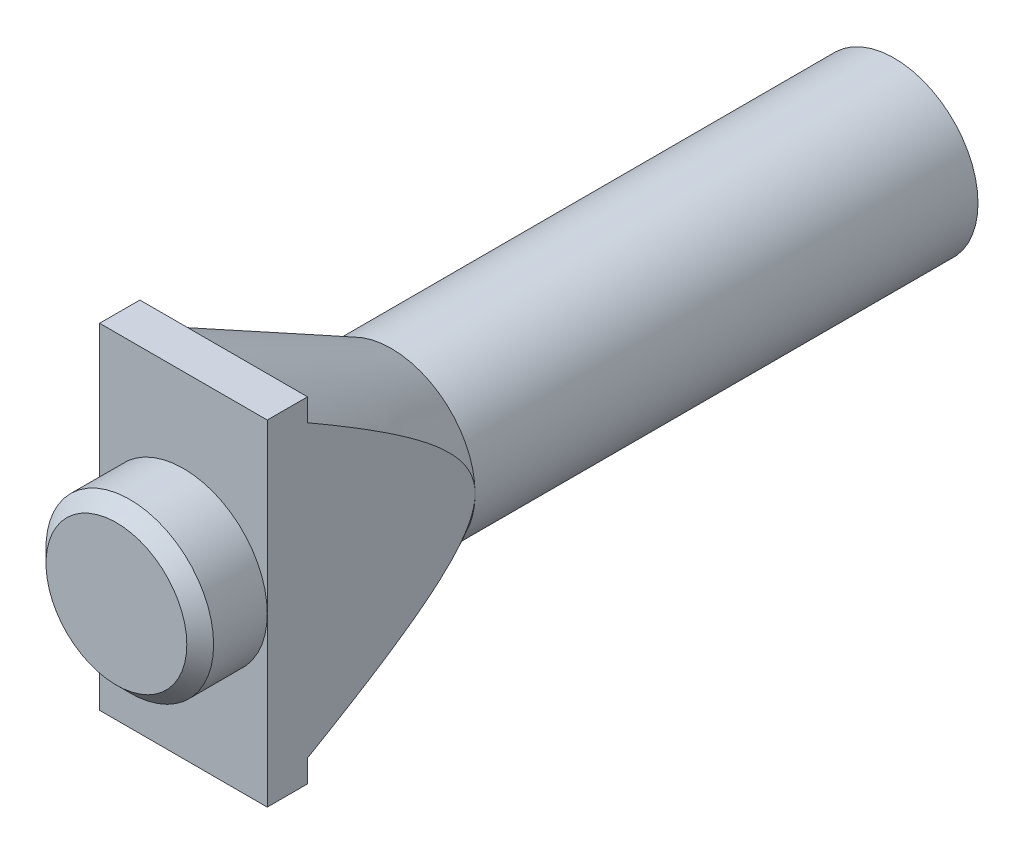
ISO-10303-21;
HEADER;
FILE_DESCRIPTION(('STEP AP214'),'2;1');
FILE_NAME('part.step','',(''),(''),'','','');
FILE_SCHEMA(('AUTOMOTIVE_DESIGN { 1 0 10303 214 1 1 1 1 }'));
ENDSEC;
DATA;
#1=APPLICATION_CONTEXT('core data for automotive mechanical design processes');
#2=APPLICATION_PROTOCOL_DEFINITION('international standard','automotive_design',2000,#1);
#3=PRODUCT_CONTEXT('',#1,'mechanical');
#4=PRODUCT('Part','Part','',(#3));
#5=PRODUCT_RELATED_PRODUCT_CATEGORY('part','',(#4));
#6=PRODUCT_DEFINITION_FORMATION('','',#4);
#7=PRODUCT_DEFINITION_CONTEXT('part definition',#1,'design');
#8=PRODUCT_DEFINITION('design','',#6,#7);
#9=PRODUCT_DEFINITION_SHAPE('','',#8);
#10=(LENGTH_UNIT() NAMED_UNIT(*) SI_UNIT(.MILLI.,.METRE.));
#11=(NAMED_UNIT(*) PLANE_ANGLE_UNIT() SI_UNIT($,.RADIAN.));
#12=(NAMED_UNIT(*) SI_UNIT($,.STERADIAN.) SOLID_ANGLE_UNIT());
#13=UNCERTAINTY_MEASURE_WITH_UNIT(LENGTH_MEASURE(1.E-05),#10,'distance_accuracy_value','');
#14=(GEOMETRIC_REPRESENTATION_CONTEXT(3) GLOBAL_UNCERTAINTY_ASSIGNED_CONTEXT((#13)) GLOBAL_UNIT_ASSIGNED_CONTEXT((#10,
#11,#12)) REPRESENTATION_CONTEXT('',''));
#15=CARTESIAN_POINT('',(0.,0.,0.));
#16=DIRECTION('',(0.,0.,1.));
#17=DIRECTION('',(1.,0.,0.));
#18=AXIS2_PLACEMENT_3D('',#15,#16,#17);
#19=CARTESIAN_POINT('',(0.,0.,53.));
#20=DIRECTION('',(0.,0.,-1.));
#21=DIRECTION('',(-1.,0.,0.));
#22=AXIS2_PLACEMENT_3D('',#19,#20,#21);
#23=PLANE('',#22);
#24=CARTESIAN_POINT('',(0.,0.,53.));
#25=DIRECTION('',(0.,0.,1.));
#26=DIRECTION('',(1.,0.,0.));
#27=AXIS2_PLACEMENT_3D('',#24,#25,#26);
#28=CIRCLE('',#27,6.25);
#29=CARTESIAN_POINT('',(6.25,0.,53.));
#30=VERTEX_POINT('',#29);
#31=CARTESIAN_POINT('',(-6.25,0.,53.));
#32=VERTEX_POINT('',#31);
#33=EDGE_CURVE('E156',#30,#32,#28,.T.);
#34=ORIENTED_EDGE('',*,*,#33,.F.);
#35=DIRECTION('',(0.,1.,0.));
#36=VECTOR('',#35,1.);
#37=CARTESIAN_POINT('',(6.25,12.5,53.));
#38=LINE('',#37,#36);
#39=CARTESIAN_POINT('',(6.25,12.5,53.));
#40=VERTEX_POINT('',#39);
#41=EDGE_CURVE('E145',#30,#40,#38,.T.);
#42=ORIENTED_EDGE('',*,*,#41,.T.);
#43=DIRECTION('',(-1.,0.,0.));
#44=VECTOR('',#43,1.);
#45=CARTESIAN_POINT('',(6.25,12.5,53.));
#46=LINE('',#45,#44);
#47=CARTESIAN_POINT('',(-6.25,12.5,53.));
#48=VERTEX_POINT('',#47);
#49=EDGE_CURVE('E144',#40,#48,#46,.T.);
#50=ORIENTED_EDGE('',*,*,#49,.T.);
#51=DIRECTION('',(0.,-1.,0.));
#52=VECTOR('',#51,1.);
#53=CARTESIAN_POINT('',(-6.25,12.5,53.));
#54=LINE('',#53,#52);
#55=EDGE_CURVE('E158',#48,#32,#54,.T.);
#56=ORIENTED_EDGE('',*,*,#55,.T.);
#57=EDGE_LOOP('',(#34,#42,#50,#56));
#58=FACE_BOUND('',#57,.T.);
#59=ADVANCED_FACE('F32',(#58),#23,.F.);
#60=CARTESIAN_POINT('',(0.,0.,37.5));
#61=DIRECTION('',(0.,0.,1.));
#62=DIRECTION('',(1.,0.,0.));
#63=AXIS2_PLACEMENT_3D('',#60,#61,#62);
#64=CONICAL_SURFACE('',#63,6.25,0.463647609000806);
#65=CARTESIAN_POINT('',(-6.24999999999999,-35.93573144479,97.9503747618082));
#66=CARTESIAN_POINT('',(-6.24999999999999,-34.9702836910054,96.0481305481626));
#67=CARTESIAN_POINT('',(-6.24999999999999,-34.0039993379035,94.146309912995));
#68=CARTESIAN_POINT('',(-6.24999999999999,-32.0690711251266,90.3438479477036));
#69=CARTESIAN_POINT('',(-6.24999999999999,-31.1004272443015,88.4432066283439));
#70=CARTESIAN_POINT('',(-6.24999999999999,-29.1595863728475,84.6424422713417));
#71=CARTESIAN_POINT('',(-6.24999999999999,-28.1873877440386,82.7423200698071));
#72=CARTESIAN_POINT('',(-6.24999999999999,-26.238887791203,78.9441960119309));
#73=CARTESIAN_POINT('',(-6.25,-25.26258649527,77.0461941411822));
#74=CARTESIAN_POINT('',(-6.25,-23.3349071551131,73.3124896487131));
#75=CARTESIAN_POINT('',(-6.24999999999999,-22.3837052780994,71.4766961897524));
#76=CARTESIAN_POINT('',(-6.25,-20.9510516696944,68.7260281776295));
#77=CARTESIAN_POINT('',(-6.25,-20.4725202155631,67.8096328086289));
#78=CARTESIAN_POINT('',(-6.25,-19.5130535891947,65.9781016754991));
#79=CARTESIAN_POINT('',(-6.25,-19.0321184191071,65.0629659102444));
#80=CARTESIAN_POINT('',(-6.25,-18.0674277023791,63.2345774080758));
#81=CARTESIAN_POINT('',(-6.25,-17.5836731658744,62.3213241384819));
#82=CARTESIAN_POINT('',(-6.25,-16.6123906148433,60.4968268430681));
#83=CARTESIAN_POINT('',(-6.25,-16.1248626078094,59.5855828132634));
#84=CARTESIAN_POINT('',(-6.25,-15.1449403322361,57.7657520186573));
#85=CARTESIAN_POINT('',(-6.25,-14.6525462258526,56.8571651666081));
#86=CARTESIAN_POINT('',(-6.25,-13.6612993133427,55.043524626133));
#87=CARTESIAN_POINT('',(-6.25,-13.1624465767017,54.138470899832));
#88=CARTESIAN_POINT('',(-6.25,-12.4188025633043,52.8048875343955));
#89=CARTESIAN_POINT('',(-6.25,-12.1774448436756,52.3744431499155));
#90=CARTESIAN_POINT('',(-6.25,-11.6923190407554,51.5149111936863));
#91=CARTESIAN_POINT('',(-6.25,-11.4485509473752,51.0858236276259));
#92=CARTESIAN_POINT('',(-6.25,-10.9580433812697,50.2291047813945));
#93=CARTESIAN_POINT('',(-6.25,-10.7113026810786,49.8014742033597));
#94=CARTESIAN_POINT('',(-6.25,-10.2143610986928,48.9482295750765));
#95=CARTESIAN_POINT('',(-6.25,-9.96416023949846,48.5226155114492));
#96=CARTESIAN_POINT('',(-6.25,-9.45598172735051,47.6679423940607));
#97=CARTESIAN_POINT('',(-6.25,-9.1979442073017,47.2389188806112));
#98=CARTESIAN_POINT('',(-6.25,-8.6764435646351,46.3841822568384));
#99=CARTESIAN_POINT('',(-6.25,-8.41298052169992,45.9584690980236));
#100=CARTESIAN_POINT('',(-6.25,-7.87941250058685,45.1118155562061));
#101=CARTESIAN_POINT('',(-6.25,-7.60931448559768,44.6908707945666));
#102=CARTESIAN_POINT('',(-6.25,-7.06016319009488,43.8548721723513));
#103=CARTESIAN_POINT('',(-6.25,-6.78111065493566,43.4398178255969));
#104=CARTESIAN_POINT('',(-6.25,-6.34527295984879,42.81169868457));
#105=CARTESIAN_POINT('',(-6.25,-6.19283759765133,42.5956164870185));
#106=CARTESIAN_POINT('',(-6.25,-5.88394271814566,42.1663525478458));
#107=CARTESIAN_POINT('',(-6.25,-5.72748336298804,41.9531706898803));
#108=CARTESIAN_POINT('',(-6.25,-5.40929477194683,41.5298295994951));
#109=CARTESIAN_POINT('',(-6.25,-5.24755199382898,41.3196805144526));
#110=CARTESIAN_POINT('',(-6.25,-4.91818990287503,40.9040565939122));
#111=CARTESIAN_POINT('',(-6.25,-4.75057126429563,40.6985812265365));
#112=CARTESIAN_POINT('',(-6.25,-4.41072215168526,40.2968566977238));
#113=CARTESIAN_POINT('',(-6.25,-4.23860266804845,40.1005141194377));
#114=CARTESIAN_POINT('',(-6.25,-3.88551868858108,39.7156793173894));
#115=CARTESIAN_POINT('',(-6.25,-3.70454949221484,39.5271913662574));
#116=CARTESIAN_POINT('',(-6.25,-3.33249315069517,39.1621773220352));
#117=CARTESIAN_POINT('',(-6.25,-3.14145694768306,38.9855996986065));
#118=CARTESIAN_POINT('',(-6.25,-2.74584936234041,38.6484644768341));
#119=CARTESIAN_POINT('',(-6.25,-2.54129780241234,38.4878842467214));
#120=CARTESIAN_POINT('',(-6.25,-2.2382128704995,38.2762964490722));
#121=CARTESIAN_POINT('',(-6.25,-2.14651659066986,38.2154739634066));
#122=CARTESIAN_POINT('',(-6.25,-1.95986552323845,38.0989611629984));
#123=CARTESIAN_POINT('',(-6.25,-1.86490998334873,38.0432720441981));
#124=CARTESIAN_POINT('',(-6.25,-1.6716234045908,37.9380341896974));
#125=CARTESIAN_POINT('',(-6.25,-1.57329210170714,37.888485935672));
#126=CARTESIAN_POINT('',(-6.25,-1.37325004902009,37.7966934985503));
#127=CARTESIAN_POINT('',(-6.25,-1.27153932185263,37.7544492665423));
#128=CARTESIAN_POINT('',(-6.25,-1.06324975162989,37.6779110254668));
#129=CARTESIAN_POINT('',(-6.25,-0.956618567932666,37.643757912331));
#130=CARTESIAN_POINT('',(-6.25,-0.740594248114185,37.5856321984595));
#131=CARTESIAN_POINT('',(-6.25,-0.631201378287124,37.5616586201095));
#132=CARTESIAN_POINT('',(-6.25,-0.410687118079889,37.5250335961711));
#133=CARTESIAN_POINT('',(-6.25,-0.299568678084801,37.5123646133956));
#134=CARTESIAN_POINT('',(-6.25,-0.0766164083812665,37.4989540416949));
#135=CARTESIAN_POINT('',(-6.25,0.035217304167892,37.4982105470561));
#136=CARTESIAN_POINT('',(-6.25,0.241256944579863,37.5078807980593));
#137=CARTESIAN_POINT('',(-6.25,0.335546095580732,37.51660758727));
#138=CARTESIAN_POINT('',(-6.25,0.523009722045783,37.5422924746225));
#139=CARTESIAN_POINT('',(-6.25,0.616183758321064,37.5592537132436));
#140=CARTESIAN_POINT('',(-6.25,0.893116937011973,37.6216666082942));
#141=CARTESIAN_POINT('',(-6.25,1.07435428792732,37.6786512465365));
#142=CARTESIAN_POINT('',(-6.25,1.38504307355533,37.8005198871093));
#143=CARTESIAN_POINT('',(-6.25,1.51658912716412,37.860332277265));
#144=CARTESIAN_POINT('',(-6.25,1.77394722069846,37.991370141334));
#145=CARTESIAN_POINT('',(-6.25,1.89975563363955,38.0626027093757));
#146=CARTESIAN_POINT('',(-6.25,2.14619737886394,38.2143632838385));
#147=CARTESIAN_POINT('',(-6.25,2.26681012481254,38.2949243001529));
#148=CARTESIAN_POINT('',(-6.25,2.50283514203065,38.463215839296));
#149=CARTESIAN_POINT('',(-6.25,2.61824874618293,38.5509445081682));
#150=CARTESIAN_POINT('',(-6.25,2.90554890951498,38.7810268383601));
#151=CARTESIAN_POINT('',(-6.25,3.07428629320175,38.9273022216295));
#152=CARTESIAN_POINT('',(-6.25,3.40283270986241,39.2296202395062));
#153=CARTESIAN_POINT('',(-6.25,3.56263610284726,39.3856689150643));
#154=CARTESIAN_POINT('',(-6.25,3.8751844495833,39.7053038795755));
#155=CARTESIAN_POINT('',(-6.25,4.02791332576028,39.8689057976443));
#156=CARTESIAN_POINT('',(-6.25,4.32721109581432,40.2015517373946));
#157=CARTESIAN_POINT('',(-6.25,4.47378136388244,40.3705945300085));
#158=CARTESIAN_POINT('',(-6.25,4.76356581930954,40.71500221121));
#159=CARTESIAN_POINT('',(-6.25,4.90671847621852,40.8904186725595));
#160=CARTESIAN_POINT('',(-6.25,5.18866683116403,41.244721252119));
#161=CARTESIAN_POINT('',(-6.25,5.32746231773531,41.4236075380495));
#162=CARTESIAN_POINT('',(-6.25,5.60117084651323,41.783923102278));
#163=CARTESIAN_POINT('',(-6.25,5.7360890689887,41.9653484550513));
#164=CARTESIAN_POINT('',(-6.25,6.00277770464985,42.3304817923942));
#165=CARTESIAN_POINT('',(-6.25,6.13454824673268,42.5141896830242));
#166=CARTESIAN_POINT('',(-6.25,6.4266860458332,42.9278256330222));
#167=CARTESIAN_POINT('',(-6.25,6.5863273646619,43.1582659675533));
#168=CARTESIAN_POINT('',(-6.25,6.90212275957881,43.6215266775284));
#169=CARTESIAN_POINT('',(-6.25,7.05827673792319,43.8543471194165));
#170=CARTESIAN_POINT('',(-6.25,7.52235749009792,44.5557787870353));
#171=CARTESIAN_POINT('',(-6.25,7.82586898694649,45.0273115392177));
#172=CARTESIAN_POINT('',(-6.25,8.42431909454614,45.976035290654));
#173=CARTESIAN_POINT('',(-6.25,8.71925396466096,46.453228634683));
#174=CARTESIAN_POINT('',(-6.25,9.30246709721191,47.4116744203898));
#175=CARTESIAN_POINT('',(-6.25,9.59074519600697,47.8929269614572));
#176=CARTESIAN_POINT('',(-6.25,10.1627483656763,48.859634804301));
#177=CARTESIAN_POINT('',(-6.25,10.4464612906979,49.3450972766051));
#178=CARTESIAN_POINT('',(-6.25,11.0097023581235,50.3184490536114));
#179=CARTESIAN_POINT('',(-6.25,11.2892304454553,50.8063383901386));
#180=CARTESIAN_POINT('',(-6.25,11.8448079120218,51.7839166280907));
#181=CARTESIAN_POINT('',(-6.25,12.1208582137854,52.2736050057992));
#182=CARTESIAN_POINT('',(-6.25,12.6701505469045,53.2545541703248));
#183=CARTESIAN_POINT('',(-6.25,12.9433925721689,53.7458149605494));
#184=CARTESIAN_POINT('',(-6.25,13.6991150202847,55.1121458598155));
#185=CARTESIAN_POINT('',(-6.25,14.179074811521,55.9886099532503));
#186=CARTESIAN_POINT('',(-6.25,15.1335494815208,57.7445821169434));
#187=CARTESIAN_POINT('',(-6.25,15.6080639231843,58.6240904242877));
#188=CARTESIAN_POINT('',(-6.25,16.5509523000127,60.3817737873868));
#189=CARTESIAN_POINT('',(-6.25,17.0193433873885,61.2599396475644));
#190=CARTESIAN_POINT('',(-6.25,17.7194433712972,62.5784533126796));
#191=CARTESIAN_POINT('',(-6.25,17.9523845365945,63.0181476712611));
#192=CARTESIAN_POINT('',(-6.25,18.4175287913747,63.8979259540562));
#193=CARTESIAN_POINT('',(-6.25,18.6497318817617,64.3380098777916));
#194=CARTESIAN_POINT('',(-6.25,18.8816078338311,64.778266145753));
#195=B_SPLINE_CURVE_WITH_KNOTS('',3,(#65,#66,#67,#68,#69,#70,#71,#72,#73,#74,#75,#76,#77,#78,
#79,#80,#81,#82,#83,#84,#85,#86,#87,#88,#89,#90,#91,#92,#93,#94,#95,#96,#97,#98,#99,#100,#101,
#102,#103,#104,#105,#106,#107,#108,#109,#110,#111,#112,#113,#114,#115,#116,#117,#118,#119,#120,
#121,#122,#123,#124,#125,#126,#127,#128,#129,#130,#131,#132,#133,#134,#135,#136,#137,#138,#139,
#140,#141,#142,#143,#144,#145,#146,#147,#148,#149,#150,#151,#152,#153,#154,#155,#156,#157,#158,
#159,#160,#161,#162,#163,#164,#165,#166,#167,#168,#169,#170,#171,#172,#173,#174,#175,#176,#177,
#178,#179,#180,#181,#182,#183,#184,#185,#186,#187,#188,#189,#190,#191,#192,#193,#194),
.UNSPECIFIED.,.F.,.F.,(4,2,2,2,2,2,2,2,2,2,2,2,2,2,2,2,2,2,2,2,2,2,2,2,2,2,2,2,2,2,2,2,2,2,2,2,
2,2,2,2,2,2,2,2,2,2,2,2,2,2,2,2,2,2,2,2,2,2,2,2,2,2,2,2,4),(0.,6.39965752074005,
12.7993726186289,19.202548560361,25.6056807264662,31.8084315940121,34.9098729818095,
38.0113115965983,41.1117000475619,44.2120823441206,47.3123616708882,50.4126076708107,
51.8930823940815,53.3735633165103,54.8546780829145,56.3357830088131,57.8376844321262,
59.3395638132854,60.8399292115256,62.3401700449834,63.1334514819569,63.9267010028383,
64.7221740075189,65.5175560283361,66.3006716211194,67.0842077829721,67.8641017849388,
68.6428763048937,68.9728468858856,69.3028941482673,69.6329672824244,69.9630382061441,
70.2984922380803,70.6339140466511,70.9688145952096,71.3036616255513,71.5873596809747,
71.8711660191168,72.4385795851788,72.8715373850204,73.3047651845618,73.7395757732675,
74.1742742494886,74.8436458955432,75.5134354489368,76.1846791595783,76.85577228922,
77.5349333072021,78.2141272359047,78.8923670098825,79.5705789622418,80.4115454698463,
81.2525355187096,82.9346941872702,84.61757583672,86.3004988119105,87.9873350797189,
89.6741935266861,91.3605946688404,93.0469994680155,96.0447948993375,99.0428293047575,
102.028634502359,103.521394662366,105.014152993186),.UNSPECIFIED.);
#196=CARTESIAN_POINT('',(-6.25,10.8253175473055,50.));
#197=VERTEX_POINT('',#196);
#198=CARTESIAN_POINT('',(-6.25,0.,37.5));
#199=VERTEX_POINT('',#198);
#200=EDGE_CURVE('E172',#197,#199,#195,.F.);
#201=ORIENTED_EDGE('',*,*,#200,.F.);
#202=CARTESIAN_POINT('',(0.,0.,50.));
#203=DIRECTION('',(0.,0.,-1.));
#204=DIRECTION('',(-1.,0.,0.));
#205=AXIS2_PLACEMENT_3D('',#202,#203,#204);
#206=CIRCLE('',#205,12.5);
#207=CARTESIAN_POINT('',(0.,12.5,50.));
#208=VERTEX_POINT('',#207);
#209=EDGE_CURVE('E571',#197,#208,#206,.T.);
#210=ORIENTED_EDGE('',*,*,#209,.T.);
#211=CARTESIAN_POINT('',(6.25,10.8253175473055,50.));
#212=VERTEX_POINT('',#211);
#213=EDGE_CURVE('E579',#208,#212,#206,.T.);
#214=ORIENTED_EDGE('',*,*,#213,.T.);
#215=CARTESIAN_POINT('',(6.25000000000001,-35.9357314447899,97.9503747618082));
#216=CARTESIAN_POINT('',(6.25000000000001,-34.9702836910053,96.0481305481626));
#217=CARTESIAN_POINT('',(6.25000000000001,-34.0039993379035,94.146309912995));
#218=CARTESIAN_POINT('',(6.25000000000001,-32.0690711251266,90.3438479477036));
#219=CARTESIAN_POINT('',(6.25000000000001,-31.1004272443015,88.4432066283439));
#220=CARTESIAN_POINT('',(6.25000000000001,-29.1595863728474,84.6424422713416));
#221=CARTESIAN_POINT('',(6.25,-28.1873877440385,82.7423200698071));
#222=CARTESIAN_POINT('',(6.25,-26.238887791203,78.9441960119309));
#223=CARTESIAN_POINT('',(6.25,-25.26258649527,77.0461941411822));
#224=CARTESIAN_POINT('',(6.25,-23.3349071551131,73.3124896487131));
#225=CARTESIAN_POINT('',(6.25,-22.3837052780994,71.4766961897524));
#226=CARTESIAN_POINT('',(6.25,-20.9510516696944,68.7260281776294));
#227=CARTESIAN_POINT('',(6.25,-20.4725202155631,67.8096328086288));
#228=CARTESIAN_POINT('',(6.25,-19.5130535891947,65.9781016754991));
#229=CARTESIAN_POINT('',(6.25,-19.0321184191071,65.0629659102444));
#230=CARTESIAN_POINT('',(6.25,-18.0674277023791,63.2345774080758));
#231=CARTESIAN_POINT('',(6.25,-17.5836731658744,62.3213241384818));
#232=CARTESIAN_POINT('',(6.25,-16.6123906148433,60.4968268430681));
#233=CARTESIAN_POINT('',(6.25,-16.1248626078094,59.5855828132634));
#234=CARTESIAN_POINT('',(6.25,-15.1449403322361,57.7657520186573));
#235=CARTESIAN_POINT('',(6.25,-14.6525462258526,56.857165166608));
#236=CARTESIAN_POINT('',(6.25,-13.6612993133427,55.043524626133));
#237=CARTESIAN_POINT('',(6.25,-13.1624465767017,54.138470899832));
#238=CARTESIAN_POINT('',(6.25,-12.4188025633043,52.8048875343955));
#239=CARTESIAN_POINT('',(6.25,-12.1774448436756,52.3744431499155));
#240=CARTESIAN_POINT('',(6.25,-11.6923190407554,51.5149111936863));
#241=CARTESIAN_POINT('',(6.25,-11.4485509473752,51.0858236276259));
#242=CARTESIAN_POINT('',(6.25,-10.9580433812697,50.2291047813945));
#243=CARTESIAN_POINT('',(6.25,-10.7113026810786,49.8014742033597));
#244=CARTESIAN_POINT('',(6.25,-10.2143610986928,48.9482295750766));
#245=CARTESIAN_POINT('',(6.25,-9.96416023949846,48.5226155114492));
#246=CARTESIAN_POINT('',(6.25,-9.45598172735052,47.6679423940607));
#247=CARTESIAN_POINT('',(6.25,-9.1979442073017,47.2389188806112));
#248=CARTESIAN_POINT('',(6.25,-8.6764435646351,46.3841822568384));
#249=CARTESIAN_POINT('',(6.25,-8.41298052169992,45.9584690980236));
#250=CARTESIAN_POINT('',(6.25,-7.87941250058685,45.1118155562061));
#251=CARTESIAN_POINT('',(6.25,-7.60931448559768,44.6908707945666));
#252=CARTESIAN_POINT('',(6.25,-7.06016319009488,43.8548721723513));
#253=CARTESIAN_POINT('',(6.25,-6.78111065493566,43.4398178255969));
#254=CARTESIAN_POINT('',(6.25,-6.34527295984879,42.81169868457));
#255=CARTESIAN_POINT('',(6.25,-6.19283759765133,42.5956164870185));
#256=CARTESIAN_POINT('',(6.25,-5.88394271814566,42.1663525478458));
#257=CARTESIAN_POINT('',(6.25,-5.72748336298804,41.9531706898803));
#258=CARTESIAN_POINT('',(6.25,-5.40929477194683,41.5298295994951));
#259=CARTESIAN_POINT('',(6.25,-5.24755199382898,41.3196805144526));
#260=CARTESIAN_POINT('',(6.25,-4.91818990287502,40.9040565939122));
#261=CARTESIAN_POINT('',(6.25,-4.75057126429562,40.6985812265365));
#262=CARTESIAN_POINT('',(6.25,-4.41072215168525,40.2968566977238));
#263=CARTESIAN_POINT('',(6.25,-4.23860266804843,40.1005141194376));
#264=CARTESIAN_POINT('',(6.25,-3.88551868858107,39.7156793173894));
#265=CARTESIAN_POINT('',(6.25,-3.70454949221482,39.5271913662574));
#266=CARTESIAN_POINT('',(6.25,-3.33249315069516,39.1621773220352));
#267=CARTESIAN_POINT('',(6.25,-3.14145694768304,38.9855996986065));
#268=CARTESIAN_POINT('',(6.25,-2.7458493623404,38.6484644768341));
#269=CARTESIAN_POINT('',(6.25,-2.54129780241234,38.4878842467214));
#270=CARTESIAN_POINT('',(6.25,-2.23821287049949,38.2762964490722));
#271=CARTESIAN_POINT('',(6.25,-2.14651659066986,38.2154739634066));
#272=CARTESIAN_POINT('',(6.25,-1.95986552323844,38.0989611629984));
#273=CARTESIAN_POINT('',(6.25,-1.86490998334872,38.0432720441981));
#274=CARTESIAN_POINT('',(6.25,-1.6716234045908,37.9380341896974));
#275=CARTESIAN_POINT('',(6.25,-1.57329210170714,37.888485935672));
#276=CARTESIAN_POINT('',(6.25,-1.37325004902009,37.7966934985503));
#277=CARTESIAN_POINT('',(6.25,-1.27153932185263,37.7544492665423));
#278=CARTESIAN_POINT('',(6.25,-1.06324975162989,37.6779110254668));
#279=CARTESIAN_POINT('',(6.25,-0.956618567932661,37.643757912331));
#280=CARTESIAN_POINT('',(6.25,-0.740594248114179,37.5856321984595));
#281=CARTESIAN_POINT('',(6.25,-0.631201378287119,37.5616586201095));
#282=CARTESIAN_POINT('',(6.25,-0.410687118079889,37.5250335961711));
#283=CARTESIAN_POINT('',(6.25,-0.299568678084807,37.5123646133956));
#284=CARTESIAN_POINT('',(6.25,-0.0766164083812734,37.4989540416949));
#285=CARTESIAN_POINT('',(6.25,0.0352173041678898,37.4982105470561));
#286=CARTESIAN_POINT('',(6.25,0.241256944579866,37.5078807980593));
#287=CARTESIAN_POINT('',(6.25,0.335546095580736,37.51660758727));
#288=CARTESIAN_POINT('',(6.25,0.523009722045787,37.5422924746225));
#289=CARTESIAN_POINT('',(6.25,0.616183758321068,37.5592537132436));
#290=CARTESIAN_POINT('',(6.25,0.893116937011978,37.6216666082942));
#291=CARTESIAN_POINT('',(6.25,1.07435428792732,37.6786512465365));
#292=CARTESIAN_POINT('',(6.25,1.38504307355533,37.8005198871093));
#293=CARTESIAN_POINT('',(6.25,1.51658912716412,37.860332277265));
#294=CARTESIAN_POINT('',(6.25,1.77394722069846,37.991370141334));
#295=CARTESIAN_POINT('',(6.25,1.89975563363955,38.0626027093757));
#296=CARTESIAN_POINT('',(6.25,2.14619737886395,38.2143632838385));
#297=CARTESIAN_POINT('',(6.25,2.26681012481255,38.2949243001529));
#298=CARTESIAN_POINT('',(6.25,2.50283514203065,38.463215839296));
#299=CARTESIAN_POINT('',(6.25,2.61824874618294,38.5509445081682));
#300=CARTESIAN_POINT('',(6.25,2.90554890951498,38.7810268383601));
#301=CARTESIAN_POINT('',(6.25,3.07428629320175,38.9273022216295));
#302=CARTESIAN_POINT('',(6.25,3.40283270986242,39.2296202395062));
#303=CARTESIAN_POINT('',(6.25,3.56263610284726,39.3856689150643));
#304=CARTESIAN_POINT('',(6.25,3.8751844495833,39.7053038795755));
#305=CARTESIAN_POINT('',(6.25,4.02791332576028,39.8689057976443));
#306=CARTESIAN_POINT('',(6.25,4.32721109581433,40.2015517373946));
#307=CARTESIAN_POINT('',(6.25,4.47378136388245,40.3705945300085));
#308=CARTESIAN_POINT('',(6.25,4.76356581930954,40.71500221121));
#309=CARTESIAN_POINT('',(6.25,4.90671847621853,40.8904186725595));
#310=CARTESIAN_POINT('',(6.25,5.18866683116404,41.244721252119));
#311=CARTESIAN_POINT('',(6.25,5.32746231773532,41.4236075380495));
#312=CARTESIAN_POINT('',(6.25,5.60117084651324,41.783923102278));
#313=CARTESIAN_POINT('',(6.25,5.73608906898871,41.9653484550513));
#314=CARTESIAN_POINT('',(6.25,6.00277770464986,42.3304817923942));
#315=CARTESIAN_POINT('',(6.25,6.13454824673269,42.5141896830242));
#316=CARTESIAN_POINT('',(6.25,6.42668604583321,42.9278256330222));
#317=CARTESIAN_POINT('',(6.25,6.58632736466191,43.1582659675533));
#318=CARTESIAN_POINT('',(6.25,6.90212275957883,43.6215266775284));
#319=CARTESIAN_POINT('',(6.25,7.05827673792321,43.8543471194166));
#320=CARTESIAN_POINT('',(6.25,7.52235749009793,44.5557787870353));
#321=CARTESIAN_POINT('',(6.25,7.82586898694649,45.0273115392178));
#322=CARTESIAN_POINT('',(6.25,8.42431909454614,45.976035290654));
#323=CARTESIAN_POINT('',(6.25,8.71925396466097,46.453228634683));
#324=CARTESIAN_POINT('',(6.25,9.30246709721192,47.4116744203898));
#325=CARTESIAN_POINT('',(6.25,9.59074519600698,47.8929269614572));
#326=CARTESIAN_POINT('',(6.25,10.1627483656763,48.859634804301));
#327=CARTESIAN_POINT('',(6.25,10.4464612906979,49.3450972766051));
#328=CARTESIAN_POINT('',(6.25,11.0097023581235,50.3184490536115));
#329=CARTESIAN_POINT('',(6.25,11.2892304454553,50.8063383901386));
#330=CARTESIAN_POINT('',(6.25,11.8448079120219,51.7839166280907));
#331=CARTESIAN_POINT('',(6.25,12.1208582137854,52.2736050057992));
#332=CARTESIAN_POINT('',(6.25,12.6701505469045,53.2545541703248));
#333=CARTESIAN_POINT('',(6.25,12.9433925721689,53.7458149605494));
#334=CARTESIAN_POINT('',(6.25,13.6991150202848,55.1121458598155));
#335=CARTESIAN_POINT('',(6.25,14.179074811521,55.9886099532503));
#336=CARTESIAN_POINT('',(6.25,15.1335494815208,57.7445821169435));
#337=CARTESIAN_POINT('',(6.25,15.6080639231843,58.6240904242877));
#338=CARTESIAN_POINT('',(6.25,16.5509523000127,60.3817737873868));
#339=CARTESIAN_POINT('',(6.25,17.0193433873886,61.2599396475645));
#340=CARTESIAN_POINT('',(6.25,17.7194433712972,62.5784533126796));
#341=CARTESIAN_POINT('',(6.25,17.9523845365945,63.0181476712612));
#342=CARTESIAN_POINT('',(6.25,18.4175287913747,63.8979259540563));
#343=CARTESIAN_POINT('',(6.25,18.6497318817617,64.3380098777917));
#344=CARTESIAN_POINT('',(6.25,18.8816078338311,64.7782661457531));
#345=B_SPLINE_CURVE_WITH_KNOTS('',3,(#215,#216,#217,#218,#219,#220,#221,#222,#223,#224,#225,
#226,#227,#228,#229,#230,#231,#232,#233,#234,#235,#236,#237,#238,#239,#240,#241,#242,#243,#244,
#245,#246,#247,#248,#249,#250,#251,#252,#253,#254,#255,#256,#257,#258,#259,#260,#261,#262,#263,
#264,#265,#266,#267,#268,#269,#270,#271,#272,#273,#274,#275,#276,#277,#278,#279,#280,#281,#282,
#283,#284,#285,#286,#287,#288,#289,#290,#291,#292,#293,#294,#295,#296,#297,#298,#299,#300,#301,
#302,#303,#304,#305,#306,#307,#308,#309,#310,#311,#312,#313,#314,#315,#316,#317,#318,#319,#320,
#321,#322,#323,#324,#325,#326,#327,#328,#329,#330,#331,#332,#333,#334,#335,#336,#337,#338,#339,
#340,#341,#342,#343,#344),.UNSPECIFIED.,.F.,.F.,(4,2,2,2,2,2,2,2,2,2,2,2,2,2,2,2,2,2,2,2,2,2,2,
2,2,2,2,2,2,2,2,2,2,2,2,2,2,2,2,2,2,2,2,2,2,2,2,2,2,2,2,2,2,2,2,2,2,2,2,2,2,2,2,2,4),(0.,
6.39965752074007,12.799372618629,19.2025485603611,25.6056807264663,31.8084315940122,
34.9098729818096,38.0113115965984,41.1117000475619,44.2120823441207,47.3123616708882,
50.4126076708107,51.8930823940815,53.3735633165103,54.8546780829145,56.3357830088131,
57.8376844321262,59.3395638132854,60.8399292115256,62.3401700449834,63.1334514819569,
63.9267010028383,64.7221740075189,65.5175560283361,66.3006716211194,67.0842077829721,
67.8641017849389,68.6428763048937,68.9728468858856,69.3028941482673,69.6329672824244,
69.9630382061441,70.2984922380803,70.6339140466511,70.9688145952095,71.3036616255513,
71.5873596809747,71.8711660191168,72.4385795851788,72.8715373850204,73.3047651845618,
73.7395757732675,74.1742742494886,74.8436458955432,75.5134354489368,76.1846791595783,
76.85577228922,77.5349333072021,78.2141272359047,78.8923670098825,79.5705789622418,
80.4115454698463,81.2525355187096,82.9346941872702,84.61757583672,86.3004988119105,
87.9873350797189,89.6741935266862,91.3605946688404,93.0469994680156,96.0447948993375,
99.0428293047575,102.028634502359,103.521394662366,105.014152993186),.UNSPECIFIED.);
#346=CARTESIAN_POINT('',(6.25,0.,37.5));
#347=VERTEX_POINT('',#346);
#348=EDGE_CURVE('E182',#347,#212,#345,.T.);
#349=ORIENTED_EDGE('',*,*,#348,.F.);
#350=CARTESIAN_POINT('',(0.,0.,37.5));
#351=DIRECTION('',(0.,0.,-1.));
#352=DIRECTION('',(-1.,0.,0.));
#353=AXIS2_PLACEMENT_3D('',#350,#351,#352);
#354=CIRCLE('',#353,6.25);
#355=EDGE_CURVE('E566',#199,#347,#354,.T.);
#356=ORIENTED_EDGE('',*,*,#355,.F.);
#357=EDGE_LOOP('',(#201,#210,#214,#349,#356));
#358=FACE_BOUND('',#357,.T.);
#359=ADVANCED_FACE('F196',(#358),#64,.T.);
#360=CARTESIAN_POINT('',(0.,0.,50.));
#361=DIRECTION('',(0.,0.,-1.));
#362=DIRECTION('',(-1.,0.,0.));
#363=AXIS2_PLACEMENT_3D('',#360,#361,#362);
#364=CYLINDRICAL_SURFACE('',#363,6.25);
#365=CARTESIAN_POINT('',(0.,0.,0.));
#366=DIRECTION('',(0.,0.,1.));
#367=DIRECTION('',(1.,0.,0.));
#368=AXIS2_PLACEMENT_3D('',#365,#366,#367);
#369=CIRCLE('',#368,6.25);
#370=CARTESIAN_POINT('',(6.25,0.,0.));
#371=VERTEX_POINT('',#370);
#372=EDGE_CURVE('E531',#371,#371,#369,.T.);
#373=ORIENTED_EDGE('',*,*,#372,.T.);
#374=EDGE_LOOP('',(#373));
#375=FACE_BOUND('',#374,.T.);
#376=EDGE_CURVE('E568',#347,#199,#354,.T.);
#377=ORIENTED_EDGE('',*,*,#376,.T.);
#378=ORIENTED_EDGE('',*,*,#355,.T.);
#379=EDGE_LOOP('',(#377,#378));
#380=FACE_BOUND('',#379,.T.);
#381=ADVANCED_FACE('F259',(#375,#380),#364,.T.);
#382=CARTESIAN_POINT('',(0.,0.,0.));
#383=DIRECTION('',(0.,0.,1.));
#384=DIRECTION('',(1.,0.,0.));
#385=AXIS2_PLACEMENT_3D('',#382,#383,#384);
#386=PLANE('',#385);
#387=CARTESIAN_POINT('',(0.,0.,0.));
#388=DIRECTION('',(0.,0.,-1.));
#389=DIRECTION('',(-1.,0.,0.));
#390=AXIS2_PLACEMENT_3D('',#387,#388,#389);
#391=CIRCLE('',#390,2.15);
#392=CARTESIAN_POINT('',(-2.15,0.,0.));
#393=VERTEX_POINT('',#392);
#394=EDGE_CURVE('E528',#393,#393,#391,.T.);
#395=ORIENTED_EDGE('',*,*,#394,.F.);
#396=EDGE_LOOP('',(#395));
#397=FACE_BOUND('',#396,.T.);
#398=ORIENTED_EDGE('',*,*,#372,.F.);
#399=EDGE_LOOP('',(#398));
#400=FACE_BOUND('',#399,.T.);
#401=ADVANCED_FACE('F256',(#397,#400),#386,.F.);
#402=CARTESIAN_POINT('',(0.,0.,25.));
#403=DIRECTION('',(0.,0.,-1.));
#404=DIRECTION('',(-1.,0.,0.));
#405=AXIS2_PLACEMENT_3D('',#402,#403,#404);
#406=CYLINDRICAL_SURFACE('',#405,2.15);
#407=CARTESIAN_POINT('',(0.,0.,25.));
#408=DIRECTION('',(0.,0.,-1.));
#409=DIRECTION('',(-1.,0.,0.));
#410=AXIS2_PLACEMENT_3D('',#407,#408,#409);
#411=CIRCLE('',#410,2.15);
#412=CARTESIAN_POINT('',(-2.15,0.,25.));
#413=VERTEX_POINT('',#412);
#414=EDGE_CURVE('E516',#413,#413,#411,.T.);
#415=ORIENTED_EDGE('',*,*,#414,.F.);
#416=EDGE_LOOP('',(#415));
#417=FACE_BOUND('',#416,.T.);
#418=ORIENTED_EDGE('',*,*,#394,.T.);
#419=EDGE_LOOP('',(#418));
#420=FACE_BOUND('',#419,.T.);
#421=ADVANCED_FACE('F252',(#417,#420),#406,.F.);
#422=CARTESIAN_POINT('',(-2.07846096908265,-3.6,28.5));
#423=DIRECTION('',(-0.866025403784439,-0.5,0.));
#424=DIRECTION('',(0.5,-0.866025403784439,0.));
#425=AXIS2_PLACEMENT_3D('',#422,#423,#424);
#426=PLANE('',#425);
#427=DIRECTION('',(-0.5,0.866025403784439,0.));
#428=VECTOR('',#427,1.);
#429=CARTESIAN_POINT('',(-2.07846096908265,-3.6,25.));
#430=LINE('',#429,#428);
#431=CARTESIAN_POINT('',(-2.07846096908265,-3.6,25.));
#432=VERTEX_POINT('',#431);
#433=CARTESIAN_POINT('',(-4.15692193816531,0.,25.));
#434=VERTEX_POINT('',#433);
#435=EDGE_CURVE('E500',#432,#434,#430,.T.);
#436=ORIENTED_EDGE('',*,*,#435,.T.);
#437=DIRECTION('',(0.,0.,-1.));
#438=VECTOR('',#437,1.);
#439=CARTESIAN_POINT('',(-4.15692193816531,0.,28.5));
#440=LINE('',#439,#438);
#441=CARTESIAN_POINT('',(-4.15692193816531,0.,28.5));
#442=VERTEX_POINT('',#441);
#443=EDGE_CURVE('E499',#442,#434,#440,.T.);
#444=ORIENTED_EDGE('',*,*,#443,.F.);
#445=DIRECTION('',(-0.5,0.866025403784439,0.));
#446=VECTOR('',#445,1.);
#447=CARTESIAN_POINT('',(-2.07846096908265,-3.6,28.5));
#448=LINE('',#447,#446);
#449=CARTESIAN_POINT('',(-2.07846096908265,-3.6,28.5));
#450=VERTEX_POINT('',#449);
#451=EDGE_CURVE('E474',#450,#442,#448,.T.);
#452=ORIENTED_EDGE('',*,*,#451,.F.);
#453=DIRECTION('',(0.,0.,-1.));
#454=VECTOR('',#453,1.);
#455=CARTESIAN_POINT('',(-2.07846096908265,-3.6,28.5));
#456=LINE('',#455,#454);
#457=EDGE_CURVE('E514',#450,#432,#456,.T.);
#458=ORIENTED_EDGE('',*,*,#457,.T.);
#459=EDGE_LOOP('',(#436,#444,#452,#458));
#460=FACE_BOUND('',#459,.T.);
#461=ADVANCED_FACE('F234',(#460),#426,.F.);
#462=CARTESIAN_POINT('',(2.07846096908265,-3.6,28.5));
#463=DIRECTION('',(0.,-1.,0.));
#464=DIRECTION('',(1.,0.,0.));
#465=AXIS2_PLACEMENT_3D('',#462,#463,#464);
#466=PLANE('',#465);
#467=DIRECTION('',(-1.,0.,0.));
#468=VECTOR('',#467,1.);
#469=CARTESIAN_POINT('',(2.07846096908265,-3.6,25.));
#470=LINE('',#469,#468);
#471=CARTESIAN_POINT('',(2.07846096908265,-3.6,25.));
#472=VERTEX_POINT('',#471);
#473=EDGE_CURVE('E481',#472,#432,#470,.T.);
#474=ORIENTED_EDGE('',*,*,#473,.T.);
#475=ORIENTED_EDGE('',*,*,#457,.F.);
#476=DIRECTION('',(-1.,0.,0.));
#477=VECTOR('',#476,1.);
#478=CARTESIAN_POINT('',(2.07846096908265,-3.6,28.5));
#479=LINE('',#478,#477);
#480=CARTESIAN_POINT('',(2.07846096908265,-3.6,28.5));
#481=VERTEX_POINT('',#480);
#482=EDGE_CURVE('E480',#481,#450,#479,.T.);
#483=ORIENTED_EDGE('',*,*,#482,.F.);
#484=DIRECTION('',(0.,0.,-1.));
#485=VECTOR('',#484,1.);
#486=CARTESIAN_POINT('',(2.07846096908265,-3.6,28.5));
#487=LINE('',#486,#485);
#488=EDGE_CURVE('E517',#481,#472,#487,.T.);
#489=ORIENTED_EDGE('',*,*,#488,.T.);
#490=EDGE_LOOP('',(#474,#475,#483,#489));
#491=FACE_BOUND('',#490,.T.);
#492=ADVANCED_FACE('F230',(#491),#466,.F.);
#493=CARTESIAN_POINT('',(4.15692193816531,0.,28.5));
#494=DIRECTION('',(0.866025403784439,-0.5,0.));
#495=DIRECTION('',(0.5,0.866025403784439,0.));
#496=AXIS2_PLACEMENT_3D('',#493,#494,#495);
#497=PLANE('',#496);
#498=DIRECTION('',(-0.5,-0.866025403784439,0.));
#499=VECTOR('',#498,1.);
#500=CARTESIAN_POINT('',(4.15692193816531,0.,25.));
#501=LINE('',#500,#499);
#502=CARTESIAN_POINT('',(4.15692193816531,0.,25.));
#503=VERTEX_POINT('',#502);
#504=EDGE_CURVE('E486',#503,#472,#501,.T.);
#505=ORIENTED_EDGE('',*,*,#504,.T.);
#506=ORIENTED_EDGE('',*,*,#488,.F.);
#507=DIRECTION('',(-0.5,-0.866025403784439,0.));
#508=VECTOR('',#507,1.);
#509=CARTESIAN_POINT('',(4.15692193816531,0.,28.5));
#510=LINE('',#509,#508);
#511=CARTESIAN_POINT('',(4.15692193816531,0.,28.5));
#512=VERTEX_POINT('',#511);
#513=EDGE_CURVE('E496',#512,#481,#510,.T.);
#514=ORIENTED_EDGE('',*,*,#513,.F.);
#515=DIRECTION('',(0.,0.,-1.));
#516=VECTOR('',#515,1.);
#517=CARTESIAN_POINT('',(4.15692193816531,0.,28.5));
#518=LINE('',#517,#516);
#519=EDGE_CURVE('E519',#512,#503,#518,.T.);
#520=ORIENTED_EDGE('',*,*,#519,.T.);
#521=EDGE_LOOP('',(#505,#506,#514,#520));
#522=FACE_BOUND('',#521,.T.);
#523=ADVANCED_FACE('F233',(#522),#497,.F.);
#524=CARTESIAN_POINT('',(2.07846096908265,3.6,28.5));
#525=DIRECTION('',(0.866025403784439,0.5,0.));
#526=DIRECTION('',(-0.5,0.866025403784439,0.));
#527=AXIS2_PLACEMENT_3D('',#524,#525,#526);
#528=PLANE('',#527);
#529=DIRECTION('',(0.5,-0.866025403784439,0.));
#530=VECTOR('',#529,1.);
#531=CARTESIAN_POINT('',(2.07846096908265,3.6,25.));
#532=LINE('',#531,#530);
#533=CARTESIAN_POINT('',(2.07846096908265,3.6,25.));
#534=VERTEX_POINT('',#533);
#535=EDGE_CURVE('E509',#534,#503,#532,.T.);
#536=ORIENTED_EDGE('',*,*,#535,.T.);
#537=ORIENTED_EDGE('',*,*,#519,.F.);
#538=DIRECTION('',(0.5,-0.866025403784439,0.));
#539=VECTOR('',#538,1.);
#540=CARTESIAN_POINT('',(2.07846096908265,3.6,28.5));
#541=LINE('',#540,#539);
#542=CARTESIAN_POINT('',(2.07846096908265,3.6,28.5));
#543=VERTEX_POINT('',#542);
#544=EDGE_CURVE('E493',#543,#512,#541,.T.);
#545=ORIENTED_EDGE('',*,*,#544,.F.);
#546=DIRECTION('',(0.,0.,-1.));
#547=VECTOR('',#546,1.);
#548=CARTESIAN_POINT('',(2.07846096908265,3.6,28.5));
#549=LINE('',#548,#547);
#550=EDGE_CURVE('E521',#543,#534,#549,.T.);
#551=ORIENTED_EDGE('',*,*,#550,.T.);
#552=EDGE_LOOP('',(#536,#537,#545,#551));
#553=FACE_BOUND('',#552,.T.);
#554=ADVANCED_FACE('F238',(#553),#528,.F.);
#555=CARTESIAN_POINT('',(-2.07846096908265,3.6,28.5));
#556=DIRECTION('',(0.,1.,0.));
#557=DIRECTION('',(0.,0.,1.));
#558=AXIS2_PLACEMENT_3D('',#555,#556,#557);
#559=PLANE('',#558);
#560=DIRECTION('',(1.,0.,0.));
#561=VECTOR('',#560,1.);
#562=CARTESIAN_POINT('',(-2.07846096908265,3.6,25.));
#563=LINE('',#562,#561);
#564=CARTESIAN_POINT('',(-2.07846096908265,3.6,25.));
#565=VERTEX_POINT('',#564);
#566=EDGE_CURVE('E506',#565,#534,#563,.T.);
#567=ORIENTED_EDGE('',*,*,#566,.T.);
#568=ORIENTED_EDGE('',*,*,#550,.F.);
#569=DIRECTION('',(1.,0.,0.));
#570=VECTOR('',#569,1.);
#571=CARTESIAN_POINT('',(-2.07846096908265,3.6,28.5));
#572=LINE('',#571,#570);
#573=CARTESIAN_POINT('',(-2.07846096908265,3.6,28.5));
#574=VERTEX_POINT('',#573);
#575=EDGE_CURVE('E483',#574,#543,#572,.T.);
#576=ORIENTED_EDGE('',*,*,#575,.F.);
#577=DIRECTION('',(0.,0.,-1.));
#578=VECTOR('',#577,1.);
#579=CARTESIAN_POINT('',(-2.07846096908265,3.6,28.5));
#580=LINE('',#579,#578);
#581=EDGE_CURVE('E523',#574,#565,#580,.T.);
#582=ORIENTED_EDGE('',*,*,#581,.T.);
#583=EDGE_LOOP('',(#567,#568,#576,#582));
#584=FACE_BOUND('',#583,.T.);
#585=ADVANCED_FACE('F242',(#584),#559,.F.);
#586=CARTESIAN_POINT('',(-4.15692193816531,0.,28.5));
#587=DIRECTION('',(-0.866025403784438,0.5,0.));
#588=DIRECTION('',(-0.5,-0.866025403784439,0.));
#589=AXIS2_PLACEMENT_3D('',#586,#587,#588);
#590=PLANE('',#589);
#591=DIRECTION('',(0.5,0.866025403784438,0.));
#592=VECTOR('',#591,1.);
#593=CARTESIAN_POINT('',(-4.15692193816531,0.,25.));
#594=LINE('',#593,#592);
#595=EDGE_CURVE('E503',#434,#565,#594,.T.);
#596=ORIENTED_EDGE('',*,*,#595,.T.);
#597=ORIENTED_EDGE('',*,*,#581,.F.);
#598=DIRECTION('',(0.5,0.866025403784438,0.));
#599=VECTOR('',#598,1.);
#600=CARTESIAN_POINT('',(-4.15692193816531,0.,28.5));
#601=LINE('',#600,#599);
#602=EDGE_CURVE('E477',#442,#574,#601,.T.);
#603=ORIENTED_EDGE('',*,*,#602,.F.);
#604=ORIENTED_EDGE('',*,*,#443,.T.);
#605=EDGE_LOOP('',(#596,#597,#603,#604));
#606=FACE_BOUND('',#605,.T.);
#607=ADVANCED_FACE('F225',(#606),#590,.F.);
#608=CARTESIAN_POINT('',(0.,0.,28.5));
#609=DIRECTION('',(0.,0.,-1.));
#610=DIRECTION('',(-1.,0.,0.));
#611=AXIS2_PLACEMENT_3D('',#608,#609,#610);
#612=PLANE('',#611);
#613=CARTESIAN_POINT('',(0.,0.,28.5));
#614=DIRECTION('',(0.,0.,-1.));
#615=DIRECTION('',(-1.,0.,0.));
#616=AXIS2_PLACEMENT_3D('',#613,#614,#615);
#617=CIRCLE('',#616,2.15);
#618=CARTESIAN_POINT('',(-2.15,0.,28.5));
#619=VERTEX_POINT('',#618);
#620=EDGE_CURVE('E160',#619,#619,#617,.T.);
#621=ORIENTED_EDGE('',*,*,#620,.F.);
#622=EDGE_LOOP('',(#621));
#623=FACE_BOUND('',#622,.T.);
#624=ORIENTED_EDGE('',*,*,#451,.T.);
#625=ORIENTED_EDGE('',*,*,#602,.T.);
#626=ORIENTED_EDGE('',*,*,#575,.T.);
#627=ORIENTED_EDGE('',*,*,#544,.T.);
#628=ORIENTED_EDGE('',*,*,#513,.T.);
#629=ORIENTED_EDGE('',*,*,#482,.T.);
#630=EDGE_LOOP('',(#624,#625,#626,#627,#628,#629));
#631=FACE_BOUND('',#630,.T.);
#632=ADVANCED_FACE('F222',(#623,#631),#612,.T.);
#633=CARTESIAN_POINT('',(0.,0.,25.));
#634=DIRECTION('',(0.,0.,-1.));
#635=DIRECTION('',(-1.,0.,0.));
#636=AXIS2_PLACEMENT_3D('',#633,#634,#635);
#637=PLANE('',#636);
#638=ORIENTED_EDGE('',*,*,#414,.T.);
#639=EDGE_LOOP('',(#638));
#640=FACE_BOUND('',#639,.T.);
#641=ORIENTED_EDGE('',*,*,#435,.F.);
#642=ORIENTED_EDGE('',*,*,#473,.F.);
#643=ORIENTED_EDGE('',*,*,#504,.F.);
#644=ORIENTED_EDGE('',*,*,#535,.F.);
#645=ORIENTED_EDGE('',*,*,#566,.F.);
#646=ORIENTED_EDGE('',*,*,#595,.F.);
#647=EDGE_LOOP('',(#641,#642,#643,#644,#645,#646));
#648=FACE_BOUND('',#647,.T.);
#649=ADVANCED_FACE('F194',(#640,#648),#637,.F.);
#650=CARTESIAN_POINT('',(-6.25,-10.8253175473055,50.));
#651=VERTEX_POINT('',#650);
#652=EDGE_CURVE('E181',#199,#651,#195,.F.);
#653=ORIENTED_EDGE('',*,*,#652,.F.);
#654=ORIENTED_EDGE('',*,*,#376,.F.);
#655=CARTESIAN_POINT('',(6.25,-10.8253175473055,50.));
#656=VERTEX_POINT('',#655);
#657=EDGE_CURVE('E55',#656,#347,#345,.T.);
#658=ORIENTED_EDGE('',*,*,#657,.F.);
#659=CARTESIAN_POINT('',(0.,0.,50.));
#660=DIRECTION('',(0.,0.,-1.));
#661=DIRECTION('',(-1.,0.,0.));
#662=AXIS2_PLACEMENT_3D('',#659,#660,#661);
#663=CIRCLE('',#662,12.5);
#664=CARTESIAN_POINT('',(0.,-12.5,50.));
#665=VERTEX_POINT('',#664);
#666=EDGE_CURVE('E163',#656,#665,#663,.T.);
#667=ORIENTED_EDGE('',*,*,#666,.T.);
#668=EDGE_CURVE('E166',#665,#651,#663,.T.);
#669=ORIENTED_EDGE('',*,*,#668,.T.);
#670=EDGE_LOOP('',(#653,#654,#658,#667,#669));
#671=FACE_BOUND('',#670,.T.);
#672=ADVANCED_FACE('F190',(#671),#64,.T.);
#673=EDGE_CURVE('E47',#32,#30,#28,.T.);
#674=ORIENTED_EDGE('',*,*,#673,.F.);
#675=CARTESIAN_POINT('',(-6.25,-12.5,53.));
#676=VERTEX_POINT('',#675);
#677=EDGE_CURVE('E559',#32,#676,#54,.T.);
#678=ORIENTED_EDGE('',*,*,#677,.T.);
#679=DIRECTION('',(1.,0.,0.));
#680=VECTOR('',#679,1.);
#681=CARTESIAN_POINT('',(6.25,-12.5,53.));
#682=LINE('',#681,#680);
#683=CARTESIAN_POINT('',(6.25,-12.5,53.));
#684=VERTEX_POINT('',#683);
#685=EDGE_CURVE('E141',#676,#684,#682,.T.);
#686=ORIENTED_EDGE('',*,*,#685,.T.);
#687=EDGE_CURVE('E137',#684,#30,#38,.T.);
#688=ORIENTED_EDGE('',*,*,#687,.T.);
#689=EDGE_LOOP('',(#674,#678,#686,#688));
#690=FACE_BOUND('',#689,.T.);
#691=ADVANCED_FACE('F139',(#690),#23,.F.);
#692=CARTESIAN_POINT('',(6.25,12.5,53.));
#693=DIRECTION('',(0.,-1.,0.));
#694=DIRECTION('',(0.,0.,-1.));
#695=AXIS2_PLACEMENT_3D('',#692,#693,#694);
#696=PLANE('',#695);
#697=DIRECTION('',(-1.,0.,0.));
#698=VECTOR('',#697,1.);
#699=CARTESIAN_POINT('',(6.25,12.5,50.));
#700=LINE('',#699,#698);
#701=CARTESIAN_POINT('',(6.25,12.5,50.));
#702=VERTEX_POINT('',#701);
#703=EDGE_CURVE('E556',#702,#208,#700,.T.);
#704=ORIENTED_EDGE('',*,*,#703,.T.);
#705=CARTESIAN_POINT('',(-6.25,12.5,50.));
#706=VERTEX_POINT('',#705);
#707=EDGE_CURVE('E555',#208,#706,#700,.T.);
#708=ORIENTED_EDGE('',*,*,#707,.T.);
#709=DIRECTION('',(0.,0.,-1.));
#710=VECTOR('',#709,1.);
#711=CARTESIAN_POINT('',(-6.25,12.5,53.));
#712=LINE('',#711,#710);
#713=EDGE_CURVE('E560',#48,#706,#712,.T.);
#714=ORIENTED_EDGE('',*,*,#713,.F.);
#715=ORIENTED_EDGE('',*,*,#49,.F.);
#716=DIRECTION('',(0.,0.,-1.));
#717=VECTOR('',#716,1.);
#718=CARTESIAN_POINT('',(6.25,12.5,53.));
#719=LINE('',#718,#717);
#720=EDGE_CURVE('E151',#40,#702,#719,.T.);
#721=ORIENTED_EDGE('',*,*,#720,.T.);
#722=EDGE_LOOP('',(#704,#708,#714,#715,#721));
#723=FACE_BOUND('',#722,.T.);
#724=ADVANCED_FACE('F201',(#723),#696,.F.);
#725=CARTESIAN_POINT('',(0.,0.,50.));
#726=DIRECTION('',(0.,0.,-1.));
#727=DIRECTION('',(-1.,0.,0.));
#728=AXIS2_PLACEMENT_3D('',#725,#726,#727);
#729=PLANE('',#728);
#730=ORIENTED_EDGE('',*,*,#666,.F.);
#731=DIRECTION('',(0.,1.,0.));
#732=VECTOR('',#731,1.);
#733=CARTESIAN_POINT('',(6.25,12.5,50.));
#734=LINE('',#733,#732);
#735=CARTESIAN_POINT('',(6.25,-12.5,50.));
#736=VERTEX_POINT('',#735);
#737=EDGE_CURVE('E546',#736,#656,#734,.T.);
#738=ORIENTED_EDGE('',*,*,#737,.F.);
#739=DIRECTION('',(1.,0.,0.));
#740=VECTOR('',#739,1.);
#741=CARTESIAN_POINT('',(6.25,-12.5,50.));
#742=LINE('',#741,#740);
#743=EDGE_CURVE('E545',#665,#736,#742,.T.);
#744=ORIENTED_EDGE('',*,*,#743,.F.);
#745=EDGE_LOOP('',(#730,#738,#744));
#746=FACE_BOUND('',#745,.T.);
#747=ADVANCED_FACE('F212',(#746),#729,.T.);
#748=CARTESIAN_POINT('',(6.25,12.5,53.));
#749=DIRECTION('',(-1.,0.,0.));
#750=DIRECTION('',(0.,-1.,0.));
#751=AXIS2_PLACEMENT_3D('',#748,#749,#750);
#752=PLANE('',#751);
#753=ORIENTED_EDGE('',*,*,#737,.T.);
#754=ORIENTED_EDGE('',*,*,#657,.T.);
#755=ORIENTED_EDGE('',*,*,#348,.T.);
#756=EDGE_CURVE('E550',#212,#702,#734,.T.);
#757=ORIENTED_EDGE('',*,*,#756,.T.);
#758=ORIENTED_EDGE('',*,*,#720,.F.);
#759=ORIENTED_EDGE('',*,*,#41,.F.);
#760=ORIENTED_EDGE('',*,*,#687,.F.);
#761=DIRECTION('',(0.,0.,-1.));
#762=VECTOR('',#761,1.);
#763=CARTESIAN_POINT('',(6.25,-12.5,53.));
#764=LINE('',#763,#762);
#765=EDGE_CURVE('E563',#684,#736,#764,.T.);
#766=ORIENTED_EDGE('',*,*,#765,.T.);
#767=EDGE_LOOP('',(#753,#754,#755,#757,#758,#759,#760,#766));
#768=FACE_BOUND('',#767,.T.);
#769=ADVANCED_FACE('F149',(#768),#752,.F.);
#770=ORIENTED_EDGE('',*,*,#213,.F.);
#771=ORIENTED_EDGE('',*,*,#703,.F.);
#772=ORIENTED_EDGE('',*,*,#756,.F.);
#773=EDGE_LOOP('',(#770,#771,#772));
#774=FACE_BOUND('',#773,.T.);
#775=ADVANCED_FACE('F209',(#774),#729,.T.);
#776=CARTESIAN_POINT('',(6.25,-12.5,53.));
#777=DIRECTION('',(0.,1.,0.));
#778=DIRECTION('',(0.,0.,1.));
#779=AXIS2_PLACEMENT_3D('',#776,#777,#778);
#780=PLANE('',#779);
#781=CARTESIAN_POINT('',(-6.25,-12.5,50.));
#782=VERTEX_POINT('',#781);
#783=EDGE_CURVE('E541',#782,#665,#742,.T.);
#784=ORIENTED_EDGE('',*,*,#783,.T.);
#785=ORIENTED_EDGE('',*,*,#743,.T.);
#786=ORIENTED_EDGE('',*,*,#765,.F.);
#787=ORIENTED_EDGE('',*,*,#685,.F.);
#788=DIRECTION('',(0.,0.,-1.));
#789=VECTOR('',#788,1.);
#790=CARTESIAN_POINT('',(-6.25,-12.5,53.));
#791=LINE('',#790,#789);
#792=EDGE_CURVE('E489',#676,#782,#791,.T.);
#793=ORIENTED_EDGE('',*,*,#792,.T.);
#794=EDGE_LOOP('',(#784,#785,#786,#787,#793));
#795=FACE_BOUND('',#794,.T.);
#796=ADVANCED_FACE('F206',(#795),#780,.F.);
#797=ORIENTED_EDGE('',*,*,#668,.F.);
#798=ORIENTED_EDGE('',*,*,#783,.F.);
#799=DIRECTION('',(0.,-1.,0.));
#800=VECTOR('',#799,1.);
#801=CARTESIAN_POINT('',(-6.25,12.5,50.));
#802=LINE('',#801,#800);
#803=EDGE_CURVE('E543',#651,#782,#802,.T.);
#804=ORIENTED_EDGE('',*,*,#803,.F.);
#805=EDGE_LOOP('',(#797,#798,#804));
#806=FACE_BOUND('',#805,.T.);
#807=ADVANCED_FACE('F202',(#806),#729,.T.);
#808=CARTESIAN_POINT('',(-6.25,12.5,53.));
#809=DIRECTION('',(1.,0.,0.));
#810=DIRECTION('',(0.,1.,0.));
#811=AXIS2_PLACEMENT_3D('',#808,#809,#810);
#812=PLANE('',#811);
#813=EDGE_CURVE('E547',#706,#197,#802,.T.);
#814=ORIENTED_EDGE('',*,*,#813,.T.);
#815=ORIENTED_EDGE('',*,*,#200,.T.);
#816=ORIENTED_EDGE('',*,*,#652,.T.);
#817=ORIENTED_EDGE('',*,*,#803,.T.);
#818=ORIENTED_EDGE('',*,*,#792,.F.);
#819=ORIENTED_EDGE('',*,*,#677,.F.);
#820=ORIENTED_EDGE('',*,*,#55,.F.);
#821=ORIENTED_EDGE('',*,*,#713,.T.);
#822=EDGE_LOOP('',(#814,#815,#816,#817,#818,#819,#820,#821));
#823=FACE_BOUND('',#822,.T.);
#824=ADVANCED_FACE('F205',(#823),#812,.F.);
#825=ORIENTED_EDGE('',*,*,#209,.F.);
#826=ORIENTED_EDGE('',*,*,#813,.F.);
#827=ORIENTED_EDGE('',*,*,#707,.F.);
#828=EDGE_LOOP('',(#825,#826,#827));
#829=FACE_BOUND('',#828,.T.);
#830=ADVANCED_FACE('F208',(#829),#729,.T.);
#831=CARTESIAN_POINT('',(0.,0.,53.));
#832=DIRECTION('',(0.,0.,-1.));
#833=DIRECTION('',(-1.,0.,0.));
#834=AXIS2_PLACEMENT_3D('',#831,#832,#833);
#835=CYLINDRICAL_SURFACE('',#834,2.15);
#836=CARTESIAN_POINT('',(0.,0.,53.));
#837=DIRECTION('',(0.,0.,-1.));
#838=DIRECTION('',(-1.,0.,0.));
#839=AXIS2_PLACEMENT_3D('',#836,#837,#838);
#840=CIRCLE('',#839,2.15);
#841=CARTESIAN_POINT('',(-2.15,0.,53.));
#842=VERTEX_POINT('',#841);
#843=EDGE_CURVE('E169',#842,#842,#840,.T.);
#844=ORIENTED_EDGE('',*,*,#843,.F.);
#845=EDGE_LOOP('',(#844));
#846=FACE_BOUND('',#845,.T.);
#847=ORIENTED_EDGE('',*,*,#620,.T.);
#848=EDGE_LOOP('',(#847));
#849=FACE_BOUND('',#848,.T.);
#850=ADVANCED_FACE('F334',(#846,#849),#835,.F.);
#851=CARTESIAN_POINT('',(0.,0.,58.));
#852=DIRECTION('',(0.,0.,1.));
#853=DIRECTION('',(1.,0.,0.));
#854=AXIS2_PLACEMENT_3D('',#851,#852,#853);
#855=PLANE('',#854);
#856=CARTESIAN_POINT('',(0.,0.,58.));
#857=DIRECTION('',(0.,0.,1.));
#858=DIRECTION('',(1.,0.,0.));
#859=AXIS2_PLACEMENT_3D('',#856,#857,#858);
#860=CIRCLE('',#859,5.25);
#861=CARTESIAN_POINT('',(5.25,0.,58.));
#862=VERTEX_POINT('',#861);
#863=EDGE_CURVE('E40',#862,#862,#860,.T.);
#864=ORIENTED_EDGE('',*,*,#863,.T.);
#865=EDGE_LOOP('',(#864));
#866=FACE_BOUND('',#865,.T.);
#867=ADVANCED_FACE('F348',(#866),#855,.T.);
#868=CARTESIAN_POINT('',(0.,0.,58.));
#869=DIRECTION('',(0.,0.,-1.));
#870=DIRECTION('',(-1.,0.,0.));
#871=AXIS2_PLACEMENT_3D('',#868,#869,#870);
#872=CYLINDRICAL_SURFACE('',#871,6.25);
#873=CARTESIAN_POINT('',(0.,0.,57.));
#874=DIRECTION('',(0.,0.,1.));
#875=DIRECTION('',(1.,0.,0.));
#876=AXIS2_PLACEMENT_3D('',#873,#874,#875);
#877=CIRCLE('',#876,6.25);
#878=CARTESIAN_POINT('',(6.25,0.,57.));
#879=VERTEX_POINT('',#878);
#880=EDGE_CURVE('E11',#879,#879,#877,.F.);
#881=ORIENTED_EDGE('',*,*,#880,.T.);
#882=EDGE_LOOP('',(#881));
#883=FACE_BOUND('',#882,.T.);
#884=ORIENTED_EDGE('',*,*,#33,.T.);
#885=ORIENTED_EDGE('',*,*,#673,.T.);
#886=EDGE_LOOP('',(#884,#885));
#887=FACE_BOUND('',#886,.T.);
#888=ADVANCED_FACE('F162',(#883,#887),#872,.T.);
#889=CARTESIAN_POINT('',(0.,0.,53.));
#890=DIRECTION('',(0.,0.,1.));
#891=DIRECTION('',(1.,0.,0.));
#892=AXIS2_PLACEMENT_3D('',#889,#890,#891);
#893=PLANE('',#892);
#894=ORIENTED_EDGE('',*,*,#843,.T.);
#895=EDGE_LOOP('',(#894));
#896=FACE_BOUND('',#895,.T.);
#897=ADVANCED_FACE('F366',(#896),#893,.F.);
#898=CARTESIAN_POINT('',(0.,0.,58.));
#899=DIRECTION('',(0.,0.,-1.));
#900=DIRECTION('',(-1.,0.,0.));
#901=AXIS2_PLACEMENT_3D('',#898,#899,#900);
#902=CONICAL_SURFACE('',#901,5.25,0.78539816339745);
#903=ORIENTED_EDGE('',*,*,#880,.F.);
#904=EDGE_LOOP('',(#903));
#905=FACE_BOUND('',#904,.T.);
#906=ORIENTED_EDGE('',*,*,#863,.F.);
#907=EDGE_LOOP('',(#906));
#908=FACE_BOUND('',#907,.T.);
#909=ADVANCED_FACE('F34',(#905,#908),#902,.T.);
#910=CLOSED_SHELL('',(#59,#359,#381,#401,#421,#461,#492,#523,#554,#585,#607,#632,#649,#672,#691,
#724,#747,#769,#775,#796,#807,#824,#830,#850,#867,#888,#897,#909));
#911=MANIFOLD_SOLID_BREP('B2',#910);
#912=ADVANCED_BREP_SHAPE_REPRESENTATION('',(#18,#911),#14);
#913=SHAPE_DEFINITION_REPRESENTATION(#9,#912);
ENDSEC;
END-ISO-10303-21;
